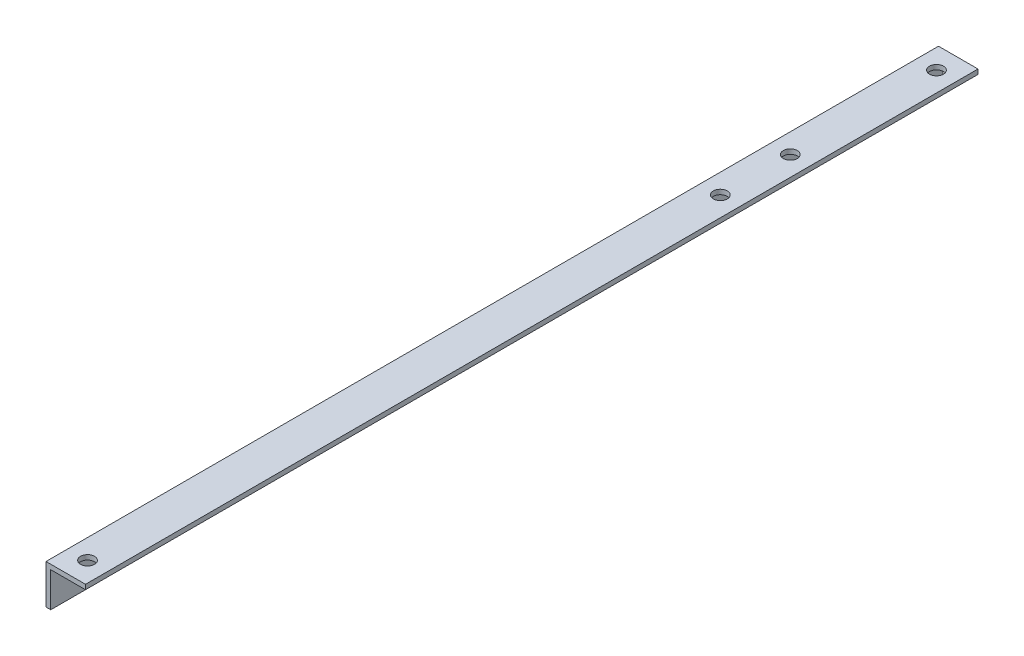
ISO-10303-21;
HEADER;
FILE_DESCRIPTION(('STEP AP214'),'2;1');
FILE_NAME('part.step','',(''),(''),'','','');
FILE_SCHEMA(('AUTOMOTIVE_DESIGN { 1 0 10303 214 1 1 1 1 }'));
ENDSEC;
DATA;
#1=APPLICATION_CONTEXT('core data for automotive mechanical design processes');
#2=APPLICATION_PROTOCOL_DEFINITION('international standard','automotive_design',2000,#1);
#3=PRODUCT_CONTEXT('',#1,'mechanical');
#4=PRODUCT('Part','Part','',(#3));
#5=PRODUCT_RELATED_PRODUCT_CATEGORY('part','',(#4));
#6=PRODUCT_DEFINITION_FORMATION('','',#4);
#7=PRODUCT_DEFINITION_CONTEXT('part definition',#1,'design');
#8=PRODUCT_DEFINITION('design','',#6,#7);
#9=PRODUCT_DEFINITION_SHAPE('','',#8);
#10=(LENGTH_UNIT() NAMED_UNIT(*) SI_UNIT(.MILLI.,.METRE.));
#11=(NAMED_UNIT(*) PLANE_ANGLE_UNIT() SI_UNIT($,.RADIAN.));
#12=(NAMED_UNIT(*) SI_UNIT($,.STERADIAN.) SOLID_ANGLE_UNIT());
#13=UNCERTAINTY_MEASURE_WITH_UNIT(LENGTH_MEASURE(1.E-05),#10,'distance_accuracy_value','');
#14=(GEOMETRIC_REPRESENTATION_CONTEXT(3) GLOBAL_UNCERTAINTY_ASSIGNED_CONTEXT((#13)) GLOBAL_UNIT_ASSIGNED_CONTEXT((#10,
#11,#12)) REPRESENTATION_CONTEXT('',''));
#15=CARTESIAN_POINT('',(0.,0.,0.));
#16=DIRECTION('',(0.,0.,1.));
#17=DIRECTION('',(1.,0.,0.));
#18=AXIS2_PLACEMENT_3D('',#15,#16,#17);
#19=CARTESIAN_POINT('',(0.,-12.7,287.));
#20=DIRECTION('',(1.,0.,0.));
#21=DIRECTION('',(0.,0.,-1.));
#22=AXIS2_PLACEMENT_3D('',#19,#20,#21);
#23=PLANE('',#22);
#24=CARTESIAN_POINT('',(0.,-6.35,125.));
#25=DIRECTION('',(-1.,0.,0.));
#26=DIRECTION('',(0.,0.,1.));
#27=AXIS2_PLACEMENT_3D('',#24,#25,#26);
#28=CIRCLE('',#27,2.24999999999999);
#29=CARTESIAN_POINT('',(0.,-6.35,127.25));
#30=VERTEX_POINT('',#29);
#31=EDGE_CURVE('E208',#30,#30,#28,.T.);
#32=ORIENTED_EDGE('',*,*,#31,.F.);
#33=EDGE_LOOP('',(#32));
#34=FACE_BOUND('',#33,.T.);
#35=CARTESIAN_POINT('',(0.,-6.35,65.));
#36=DIRECTION('',(-1.,0.,0.));
#37=DIRECTION('',(0.,0.,1.));
#38=AXIS2_PLACEMENT_3D('',#35,#36,#37);
#39=CIRCLE('',#38,2.24999999999999);
#40=CARTESIAN_POINT('',(0.,-6.35,67.25));
#41=VERTEX_POINT('',#40);
#42=EDGE_CURVE('E212',#41,#41,#39,.T.);
#43=ORIENTED_EDGE('',*,*,#42,.F.);
#44=EDGE_LOOP('',(#43));
#45=FACE_BOUND('',#44,.T.);
#46=CARTESIAN_POINT('',(0.,-6.35,185.));
#47=DIRECTION('',(-1.,0.,0.));
#48=DIRECTION('',(0.,0.,1.));
#49=AXIS2_PLACEMENT_3D('',#46,#47,#48);
#50=CIRCLE('',#49,2.24999999999999);
#51=CARTESIAN_POINT('',(0.,-6.35,187.25));
#52=VERTEX_POINT('',#51);
#53=EDGE_CURVE('E215',#52,#52,#50,.T.);
#54=ORIENTED_EDGE('',*,*,#53,.F.);
#55=EDGE_LOOP('',(#54));
#56=FACE_BOUND('',#55,.T.);
#57=DIRECTION('',(0.,-1.,0.));
#58=VECTOR('',#57,1.);
#59=CARTESIAN_POINT('',(0.,-12.7,0.));
#60=LINE('',#59,#58);
#61=CARTESIAN_POINT('',(0.,0.,0.));
#62=VERTEX_POINT('',#61);
#63=CARTESIAN_POINT('',(0.,-12.7,0.));
#64=VERTEX_POINT('',#63);
#65=EDGE_CURVE('E139',#62,#64,#60,.T.);
#66=ORIENTED_EDGE('',*,*,#65,.T.);
#67=DIRECTION('',(0.,0.,-1.));
#68=VECTOR('',#67,1.);
#69=CARTESIAN_POINT('',(0.,-12.7,287.));
#70=LINE('',#69,#68);
#71=CARTESIAN_POINT('',(0.,-12.7,287.));
#72=VERTEX_POINT('',#71);
#73=EDGE_CURVE('E13',#72,#64,#70,.T.);
#74=ORIENTED_EDGE('',*,*,#73,.F.);
#75=DIRECTION('',(0.,-1.,0.));
#76=VECTOR('',#75,1.);
#77=CARTESIAN_POINT('',(0.,-12.7,287.));
#78=LINE('',#77,#76);
#79=CARTESIAN_POINT('',(0.,0.,287.));
#80=VERTEX_POINT('',#79);
#81=EDGE_CURVE('E150',#80,#72,#78,.T.);
#82=ORIENTED_EDGE('',*,*,#81,.F.);
#83=DIRECTION('',(0.,0.,-1.));
#84=VECTOR('',#83,1.);
#85=CARTESIAN_POINT('',(0.,0.,287.));
#86=LINE('',#85,#84);
#87=EDGE_CURVE('E135',#80,#62,#86,.T.);
#88=ORIENTED_EDGE('',*,*,#87,.T.);
#89=EDGE_LOOP('',(#66,#74,#82,#88));
#90=FACE_BOUND('',#89,.T.);
#91=ADVANCED_FACE('F51',(#34,#45,#56,#90),#23,.F.);
#92=CARTESIAN_POINT('',(1.524,-12.7,287.));
#93=DIRECTION('',(0.,1.,0.));
#94=DIRECTION('',(0.,0.,1.));
#95=AXIS2_PLACEMENT_3D('',#92,#93,#94);
#96=PLANE('',#95);
#97=DIRECTION('',(1.,0.,0.));
#98=VECTOR('',#97,1.);
#99=CARTESIAN_POINT('',(1.524,-12.7,0.));
#100=LINE('',#99,#98);
#101=CARTESIAN_POINT('',(1.524,-12.7,0.));
#102=VERTEX_POINT('',#101);
#103=EDGE_CURVE('E142',#64,#102,#100,.T.);
#104=ORIENTED_EDGE('',*,*,#103,.T.);
#105=DIRECTION('',(0.,0.,-1.));
#106=VECTOR('',#105,1.);
#107=CARTESIAN_POINT('',(1.524,-12.7,287.));
#108=LINE('',#107,#106);
#109=CARTESIAN_POINT('',(1.524,-12.7,287.));
#110=VERTEX_POINT('',#109);
#111=EDGE_CURVE('E61',#110,#102,#108,.T.);
#112=ORIENTED_EDGE('',*,*,#111,.F.);
#113=DIRECTION('',(1.,0.,0.));
#114=VECTOR('',#113,1.);
#115=CARTESIAN_POINT('',(1.524,-12.7,287.));
#116=LINE('',#115,#114);
#117=EDGE_CURVE('E107',#72,#110,#116,.T.);
#118=ORIENTED_EDGE('',*,*,#117,.F.);
#119=ORIENTED_EDGE('',*,*,#73,.T.);
#120=EDGE_LOOP('',(#104,#112,#118,#119));
#121=FACE_BOUND('',#120,.T.);
#122=ADVANCED_FACE('F179',(#121),#96,.F.);
#123=CARTESIAN_POINT('',(1.524,-1.524,287.));
#124=DIRECTION('',(-1.,0.,0.));
#125=DIRECTION('',(0.,-1.,0.));
#126=AXIS2_PLACEMENT_3D('',#123,#124,#125);
#127=PLANE('',#126);
#128=CARTESIAN_POINT('',(1.524,-6.35,125.));
#129=DIRECTION('',(-1.,0.,0.));
#130=DIRECTION('',(0.,-1.,0.));
#131=AXIS2_PLACEMENT_3D('',#128,#129,#130);
#132=CIRCLE('',#131,2.24999999999997);
#133=CARTESIAN_POINT('',(1.524,-8.59999999999997,125.));
#134=VERTEX_POINT('',#133);
#135=EDGE_CURVE('E347',#134,#134,#132,.T.);
#136=ORIENTED_EDGE('',*,*,#135,.T.);
#137=EDGE_LOOP('',(#136));
#138=FACE_BOUND('',#137,.T.);
#139=CARTESIAN_POINT('',(1.524,-6.35,65.));
#140=DIRECTION('',(-1.,0.,0.));
#141=DIRECTION('',(0.,-1.,0.));
#142=AXIS2_PLACEMENT_3D('',#139,#140,#141);
#143=CIRCLE('',#142,2.24999999999997);
#144=CARTESIAN_POINT('',(1.524,-8.59999999999997,65.));
#145=VERTEX_POINT('',#144);
#146=EDGE_CURVE('E54',#145,#145,#143,.T.);
#147=ORIENTED_EDGE('',*,*,#146,.T.);
#148=EDGE_LOOP('',(#147));
#149=FACE_BOUND('',#148,.T.);
#150=CARTESIAN_POINT('',(1.524,-6.35,185.));
#151=DIRECTION('',(-1.,0.,0.));
#152=DIRECTION('',(0.,-1.,0.));
#153=AXIS2_PLACEMENT_3D('',#150,#151,#152);
#154=CIRCLE('',#153,2.24999999999997);
#155=CARTESIAN_POINT('',(1.524,-8.59999999999997,185.));
#156=VERTEX_POINT('',#155);
#157=EDGE_CURVE('E217',#156,#156,#154,.T.);
#158=ORIENTED_EDGE('',*,*,#157,.T.);
#159=EDGE_LOOP('',(#158));
#160=FACE_BOUND('',#159,.T.);
#161=DIRECTION('',(0.,1.,0.));
#162=VECTOR('',#161,1.);
#163=CARTESIAN_POINT('',(1.524,-1.524,0.));
#164=LINE('',#163,#162);
#165=CARTESIAN_POINT('',(1.524,-1.524,0.));
#166=VERTEX_POINT('',#165);
#167=EDGE_CURVE('E145',#102,#166,#164,.T.);
#168=ORIENTED_EDGE('',*,*,#167,.T.);
#169=DIRECTION('',(0.,0.,-1.));
#170=VECTOR('',#169,1.);
#171=CARTESIAN_POINT('',(1.524,-1.524,287.));
#172=LINE('',#171,#170);
#173=CARTESIAN_POINT('',(1.524,-1.524,287.));
#174=VERTEX_POINT('',#173);
#175=EDGE_CURVE('E130',#174,#166,#172,.T.);
#176=ORIENTED_EDGE('',*,*,#175,.F.);
#177=DIRECTION('',(0.,1.,0.));
#178=VECTOR('',#177,1.);
#179=CARTESIAN_POINT('',(1.524,-1.524,287.));
#180=LINE('',#179,#178);
#181=EDGE_CURVE('E120',#110,#174,#180,.T.);
#182=ORIENTED_EDGE('',*,*,#181,.F.);
#183=ORIENTED_EDGE('',*,*,#111,.T.);
#184=EDGE_LOOP('',(#168,#176,#182,#183));
#185=FACE_BOUND('',#184,.T.);
#186=ADVANCED_FACE('F182',(#138,#149,#160,#185),#127,.F.);
#187=CARTESIAN_POINT('',(12.7,-1.524,287.));
#188=DIRECTION('',(0.,1.,0.));
#189=DIRECTION('',(-1.,0.,0.));
#190=AXIS2_PLACEMENT_3D('',#187,#188,#189);
#191=PLANE('',#190);
#192=CARTESIAN_POINT('',(6.35,-1.524,7.));
#193=DIRECTION('',(0.,1.,0.));
#194=DIRECTION('',(-1.,0.,0.));
#195=AXIS2_PLACEMENT_3D('',#192,#193,#194);
#196=CIRCLE('',#195,2.24999999999997);
#197=CARTESIAN_POINT('',(4.10000000000003,-1.524,7.));
#198=VERTEX_POINT('',#197);
#199=EDGE_CURVE('E229',#198,#198,#196,.T.);
#200=ORIENTED_EDGE('',*,*,#199,.T.);
#201=EDGE_LOOP('',(#200));
#202=FACE_BOUND('',#201,.T.);
#203=CARTESIAN_POINT('',(6.35,-1.524,280.));
#204=DIRECTION('',(0.,1.,0.));
#205=DIRECTION('',(-1.,0.,0.));
#206=AXIS2_PLACEMENT_3D('',#203,#204,#205);
#207=CIRCLE('',#206,2.24999999999997);
#208=CARTESIAN_POINT('',(4.10000000000003,-1.524,280.));
#209=VERTEX_POINT('',#208);
#210=EDGE_CURVE('E235',#209,#209,#207,.T.);
#211=ORIENTED_EDGE('',*,*,#210,.T.);
#212=EDGE_LOOP('',(#211));
#213=FACE_BOUND('',#212,.T.);
#214=CARTESIAN_POINT('',(6.35,-1.524,54.));
#215=DIRECTION('',(0.,1.,0.));
#216=DIRECTION('',(-1.,0.,0.));
#217=AXIS2_PLACEMENT_3D('',#214,#215,#216);
#218=CIRCLE('',#217,2.24999999999997);
#219=CARTESIAN_POINT('',(4.10000000000003,-1.524,54.));
#220=VERTEX_POINT('',#219);
#221=EDGE_CURVE('E166',#220,#220,#218,.T.);
#222=ORIENTED_EDGE('',*,*,#221,.T.);
#223=EDGE_LOOP('',(#222));
#224=FACE_BOUND('',#223,.T.);
#225=CARTESIAN_POINT('',(6.35,-1.524,76.5));
#226=DIRECTION('',(0.,1.,0.));
#227=DIRECTION('',(-1.,0.,0.));
#228=AXIS2_PLACEMENT_3D('',#225,#226,#227);
#229=CIRCLE('',#228,2.24999999999997);
#230=CARTESIAN_POINT('',(4.10000000000003,-1.524,76.5));
#231=VERTEX_POINT('',#230);
#232=EDGE_CURVE('E143',#231,#231,#229,.T.);
#233=ORIENTED_EDGE('',*,*,#232,.T.);
#234=EDGE_LOOP('',(#233));
#235=FACE_BOUND('',#234,.T.);
#236=DIRECTION('',(1.,0.,0.));
#237=VECTOR('',#236,1.);
#238=CARTESIAN_POINT('',(12.7,-1.524,0.));
#239=LINE('',#238,#237);
#240=CARTESIAN_POINT('',(12.7,-1.524,0.));
#241=VERTEX_POINT('',#240);
#242=EDGE_CURVE('E128',#166,#241,#239,.T.);
#243=ORIENTED_EDGE('',*,*,#242,.T.);
#244=DIRECTION('',(0.,0.,-1.));
#245=VECTOR('',#244,1.);
#246=CARTESIAN_POINT('',(12.7,-1.524,287.));
#247=LINE('',#246,#245);
#248=CARTESIAN_POINT('',(12.7,-1.524,287.));
#249=VERTEX_POINT('',#248);
#250=EDGE_CURVE('E125',#249,#241,#247,.T.);
#251=ORIENTED_EDGE('',*,*,#250,.F.);
#252=DIRECTION('',(1.,0.,0.));
#253=VECTOR('',#252,1.);
#254=CARTESIAN_POINT('',(12.7,-1.524,287.));
#255=LINE('',#254,#253);
#256=EDGE_CURVE('E114',#174,#249,#255,.T.);
#257=ORIENTED_EDGE('',*,*,#256,.F.);
#258=ORIENTED_EDGE('',*,*,#175,.T.);
#259=EDGE_LOOP('',(#243,#251,#257,#258));
#260=FACE_BOUND('',#259,.T.);
#261=ADVANCED_FACE('F126',(#202,#213,#224,#235,#260),#191,.F.);
#262=CARTESIAN_POINT('',(12.7,0.,287.));
#263=DIRECTION('',(-1.,0.,0.));
#264=DIRECTION('',(0.,0.,1.));
#265=AXIS2_PLACEMENT_3D('',#262,#263,#264);
#266=PLANE('',#265);
#267=DIRECTION('',(0.,1.,0.));
#268=VECTOR('',#267,1.);
#269=CARTESIAN_POINT('',(12.7,0.,0.));
#270=LINE('',#269,#268);
#271=CARTESIAN_POINT('',(12.7,0.,0.));
#272=VERTEX_POINT('',#271);
#273=EDGE_CURVE('E93',#241,#272,#270,.T.);
#274=ORIENTED_EDGE('',*,*,#273,.T.);
#275=DIRECTION('',(0.,0.,-1.));
#276=VECTOR('',#275,1.);
#277=CARTESIAN_POINT('',(12.7,0.,287.));
#278=LINE('',#277,#276);
#279=CARTESIAN_POINT('',(12.7,0.,287.));
#280=VERTEX_POINT('',#279);
#281=EDGE_CURVE('E131',#280,#272,#278,.T.);
#282=ORIENTED_EDGE('',*,*,#281,.F.);
#283=DIRECTION('',(0.,1.,0.));
#284=VECTOR('',#283,1.);
#285=CARTESIAN_POINT('',(12.7,0.,287.));
#286=LINE('',#285,#284);
#287=EDGE_CURVE('E118',#249,#280,#286,.T.);
#288=ORIENTED_EDGE('',*,*,#287,.F.);
#289=ORIENTED_EDGE('',*,*,#250,.T.);
#290=EDGE_LOOP('',(#274,#282,#288,#289));
#291=FACE_BOUND('',#290,.T.);
#292=ADVANCED_FACE('F133',(#291),#266,.F.);
#293=CARTESIAN_POINT('',(0.,0.,287.));
#294=DIRECTION('',(0.,-1.,0.));
#295=DIRECTION('',(0.,0.,-1.));
#296=AXIS2_PLACEMENT_3D('',#293,#294,#295);
#297=PLANE('',#296);
#298=CARTESIAN_POINT('',(6.35,0.,7.));
#299=DIRECTION('',(0.,1.,0.));
#300=DIRECTION('',(0.,0.,1.));
#301=AXIS2_PLACEMENT_3D('',#298,#299,#300);
#302=CIRCLE('',#301,2.24999999999999);
#303=CARTESIAN_POINT('',(6.35,0.,9.24999999999999));
#304=VERTEX_POINT('',#303);
#305=EDGE_CURVE('E220',#304,#304,#302,.T.);
#306=ORIENTED_EDGE('',*,*,#305,.F.);
#307=EDGE_LOOP('',(#306));
#308=FACE_BOUND('',#307,.T.);
#309=CARTESIAN_POINT('',(6.35,0.,280.));
#310=DIRECTION('',(0.,1.,0.));
#311=DIRECTION('',(0.,0.,1.));
#312=AXIS2_PLACEMENT_3D('',#309,#310,#311);
#313=CIRCLE('',#312,2.24999999999999);
#314=CARTESIAN_POINT('',(6.35,0.,282.25));
#315=VERTEX_POINT('',#314);
#316=EDGE_CURVE('E232',#315,#315,#313,.T.);
#317=ORIENTED_EDGE('',*,*,#316,.F.);
#318=EDGE_LOOP('',(#317));
#319=FACE_BOUND('',#318,.T.);
#320=CARTESIAN_POINT('',(6.35,0.,54.));
#321=DIRECTION('',(0.,1.,0.));
#322=DIRECTION('',(0.,0.,1.));
#323=AXIS2_PLACEMENT_3D('',#320,#321,#322);
#324=CIRCLE('',#323,2.24999999999999);
#325=CARTESIAN_POINT('',(6.35,0.,56.25));
#326=VERTEX_POINT('',#325);
#327=EDGE_CURVE('E172',#326,#326,#324,.T.);
#328=ORIENTED_EDGE('',*,*,#327,.F.);
#329=EDGE_LOOP('',(#328));
#330=FACE_BOUND('',#329,.T.);
#331=CARTESIAN_POINT('',(6.35,0.,76.5));
#332=DIRECTION('',(0.,1.,0.));
#333=DIRECTION('',(0.,0.,1.));
#334=AXIS2_PLACEMENT_3D('',#331,#332,#333);
#335=CIRCLE('',#334,2.24999999999999);
#336=CARTESIAN_POINT('',(6.35,0.,78.75));
#337=VERTEX_POINT('',#336);
#338=EDGE_CURVE('E161',#337,#337,#335,.T.);
#339=ORIENTED_EDGE('',*,*,#338,.F.);
#340=EDGE_LOOP('',(#339));
#341=FACE_BOUND('',#340,.T.);
#342=DIRECTION('',(-1.,0.,0.));
#343=VECTOR('',#342,1.);
#344=CARTESIAN_POINT('',(0.,0.,0.));
#345=LINE('',#344,#343);
#346=EDGE_CURVE('E99',#272,#62,#345,.T.);
#347=ORIENTED_EDGE('',*,*,#346,.T.);
#348=ORIENTED_EDGE('',*,*,#87,.F.);
#349=DIRECTION('',(-1.,0.,0.));
#350=VECTOR('',#349,1.);
#351=CARTESIAN_POINT('',(0.,0.,287.));
#352=LINE('',#351,#350);
#353=EDGE_CURVE('E70',#280,#80,#352,.T.);
#354=ORIENTED_EDGE('',*,*,#353,.F.);
#355=ORIENTED_EDGE('',*,*,#281,.T.);
#356=EDGE_LOOP('',(#347,#348,#354,#355));
#357=FACE_BOUND('',#356,.T.);
#358=ADVANCED_FACE('F187',(#308,#319,#330,#341,#357),#297,.F.);
#359=CARTESIAN_POINT('',(0.,0.,287.));
#360=DIRECTION('',(0.,0.,-1.));
#361=DIRECTION('',(-1.,0.,0.));
#362=AXIS2_PLACEMENT_3D('',#359,#360,#361);
#363=PLANE('',#362);
#364=ORIENTED_EDGE('',*,*,#81,.T.);
#365=ORIENTED_EDGE('',*,*,#117,.T.);
#366=ORIENTED_EDGE('',*,*,#181,.T.);
#367=ORIENTED_EDGE('',*,*,#256,.T.);
#368=ORIENTED_EDGE('',*,*,#287,.T.);
#369=ORIENTED_EDGE('',*,*,#353,.T.);
#370=EDGE_LOOP('',(#364,#365,#366,#367,#368,#369));
#371=FACE_BOUND('',#370,.T.);
#372=ADVANCED_FACE('F116',(#371),#363,.F.);
#373=CARTESIAN_POINT('',(0.,0.,0.));
#374=DIRECTION('',(0.,0.,-1.));
#375=DIRECTION('',(-1.,0.,0.));
#376=AXIS2_PLACEMENT_3D('',#373,#374,#375);
#377=PLANE('',#376);
#378=ORIENTED_EDGE('',*,*,#65,.F.);
#379=ORIENTED_EDGE('',*,*,#346,.F.);
#380=ORIENTED_EDGE('',*,*,#273,.F.);
#381=ORIENTED_EDGE('',*,*,#242,.F.);
#382=ORIENTED_EDGE('',*,*,#167,.F.);
#383=ORIENTED_EDGE('',*,*,#103,.F.);
#384=EDGE_LOOP('',(#378,#379,#380,#381,#382,#383));
#385=FACE_BOUND('',#384,.T.);
#386=ADVANCED_FACE('F185',(#385),#377,.T.);
#387=CARTESIAN_POINT('',(6.35,0.,76.5));
#388=DIRECTION('',(0.,1.,0.));
#389=DIRECTION('',(0.,0.,1.));
#390=AXIS2_PLACEMENT_3D('',#387,#388,#389);
#391=CYLINDRICAL_SURFACE('',#390,2.24999999999997);
#392=ORIENTED_EDGE('',*,*,#338,.T.);
#393=EDGE_LOOP('',(#392));
#394=FACE_BOUND('',#393,.T.);
#395=ORIENTED_EDGE('',*,*,#232,.F.);
#396=EDGE_LOOP('',(#395));
#397=FACE_BOUND('',#396,.T.);
#398=ADVANCED_FACE('F247',(#394,#397),#391,.F.);
#399=CARTESIAN_POINT('',(6.35,0.,54.));
#400=DIRECTION('',(0.,1.,0.));
#401=DIRECTION('',(0.,0.,1.));
#402=AXIS2_PLACEMENT_3D('',#399,#400,#401);
#403=CYLINDRICAL_SURFACE('',#402,2.24999999999997);
#404=ORIENTED_EDGE('',*,*,#327,.T.);
#405=EDGE_LOOP('',(#404));
#406=FACE_BOUND('',#405,.T.);
#407=ORIENTED_EDGE('',*,*,#221,.F.);
#408=EDGE_LOOP('',(#407));
#409=FACE_BOUND('',#408,.T.);
#410=ADVANCED_FACE('F241',(#406,#409),#403,.F.);
#411=CARTESIAN_POINT('',(6.35,0.,280.));
#412=DIRECTION('',(0.,1.,0.));
#413=DIRECTION('',(0.,0.,1.));
#414=AXIS2_PLACEMENT_3D('',#411,#412,#413);
#415=CYLINDRICAL_SURFACE('',#414,2.24999999999997);
#416=ORIENTED_EDGE('',*,*,#316,.T.);
#417=EDGE_LOOP('',(#416));
#418=FACE_BOUND('',#417,.T.);
#419=ORIENTED_EDGE('',*,*,#210,.F.);
#420=EDGE_LOOP('',(#419));
#421=FACE_BOUND('',#420,.T.);
#422=ADVANCED_FACE('F246',(#418,#421),#415,.F.);
#423=CARTESIAN_POINT('',(6.35,0.,7.));
#424=DIRECTION('',(0.,1.,0.));
#425=DIRECTION('',(0.,0.,1.));
#426=AXIS2_PLACEMENT_3D('',#423,#424,#425);
#427=CYLINDRICAL_SURFACE('',#426,2.24999999999997);
#428=ORIENTED_EDGE('',*,*,#305,.T.);
#429=EDGE_LOOP('',(#428));
#430=FACE_BOUND('',#429,.T.);
#431=ORIENTED_EDGE('',*,*,#199,.F.);
#432=EDGE_LOOP('',(#431));
#433=FACE_BOUND('',#432,.T.);
#434=ADVANCED_FACE('F264',(#430,#433),#427,.F.);
#435=CARTESIAN_POINT('',(0.,-6.35,185.));
#436=DIRECTION('',(-1.,0.,0.));
#437=DIRECTION('',(0.,0.,1.));
#438=AXIS2_PLACEMENT_3D('',#435,#436,#437);
#439=CYLINDRICAL_SURFACE('',#438,2.24999999999997);
#440=ORIENTED_EDGE('',*,*,#53,.T.);
#441=EDGE_LOOP('',(#440));
#442=FACE_BOUND('',#441,.T.);
#443=ORIENTED_EDGE('',*,*,#157,.F.);
#444=EDGE_LOOP('',(#443));
#445=FACE_BOUND('',#444,.T.);
#446=ADVANCED_FACE('F270',(#442,#445),#439,.F.);
#447=CARTESIAN_POINT('',(0.,-6.35,65.));
#448=DIRECTION('',(-1.,0.,0.));
#449=DIRECTION('',(0.,0.,1.));
#450=AXIS2_PLACEMENT_3D('',#447,#448,#449);
#451=CYLINDRICAL_SURFACE('',#450,2.24999999999997);
#452=ORIENTED_EDGE('',*,*,#42,.T.);
#453=EDGE_LOOP('',(#452));
#454=FACE_BOUND('',#453,.T.);
#455=ORIENTED_EDGE('',*,*,#146,.F.);
#456=EDGE_LOOP('',(#455));
#457=FACE_BOUND('',#456,.T.);
#458=ADVANCED_FACE('F322',(#454,#457),#451,.F.);
#459=CARTESIAN_POINT('',(0.,-6.35,125.));
#460=DIRECTION('',(-1.,0.,0.));
#461=DIRECTION('',(0.,0.,1.));
#462=AXIS2_PLACEMENT_3D('',#459,#460,#461);
#463=CYLINDRICAL_SURFACE('',#462,2.24999999999997);
#464=ORIENTED_EDGE('',*,*,#31,.T.);
#465=EDGE_LOOP('',(#464));
#466=FACE_BOUND('',#465,.T.);
#467=ORIENTED_EDGE('',*,*,#135,.F.);
#468=EDGE_LOOP('',(#467));
#469=FACE_BOUND('',#468,.T.);
#470=ADVANCED_FACE('F330',(#466,#469),#463,.F.);
#471=CLOSED_SHELL('',(#91,#122,#186,#261,#292,#358,#372,#386,#398,#410,#422,#434,#446,#458,#470));
#472=MANIFOLD_SOLID_BREP('B2',#471);
#473=ADVANCED_BREP_SHAPE_REPRESENTATION('',(#18,#472),#14);
#474=SHAPE_DEFINITION_REPRESENTATION(#9,#473);
ENDSEC;
END-ISO-10303-21;
